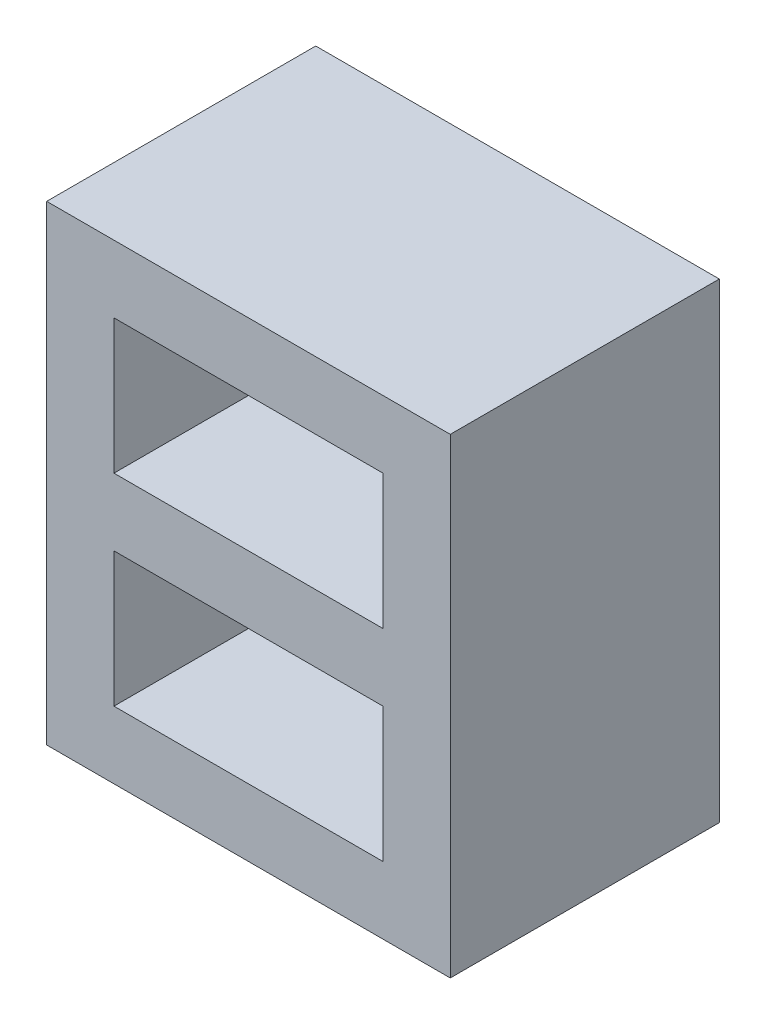
ISO-10303-21;
HEADER;
FILE_DESCRIPTION(('STEP AP214'),'2;1');
FILE_NAME('part.step','',(''),(''),'','','');
FILE_SCHEMA(('AUTOMOTIVE_DESIGN { 1 0 10303 214 1 1 1 1 }'));
ENDSEC;
DATA;
#1=APPLICATION_CONTEXT('core data for automotive mechanical design processes');
#2=APPLICATION_PROTOCOL_DEFINITION('international standard','automotive_design',2000,#1);
#3=PRODUCT_CONTEXT('',#1,'mechanical');
#4=PRODUCT('Part','Part','',(#3));
#5=PRODUCT_RELATED_PRODUCT_CATEGORY('part','',(#4));
#6=PRODUCT_DEFINITION_FORMATION('','',#4);
#7=PRODUCT_DEFINITION_CONTEXT('part definition',#1,'design');
#8=PRODUCT_DEFINITION('design','',#6,#7);
#9=PRODUCT_DEFINITION_SHAPE('','',#8);
#10=(LENGTH_UNIT() NAMED_UNIT(*) SI_UNIT(.MILLI.,.METRE.));
#11=(NAMED_UNIT(*) PLANE_ANGLE_UNIT() SI_UNIT($,.RADIAN.));
#12=(NAMED_UNIT(*) SI_UNIT($,.STERADIAN.) SOLID_ANGLE_UNIT());
#13=UNCERTAINTY_MEASURE_WITH_UNIT(LENGTH_MEASURE(1.E-05),#10,'distance_accuracy_value','');
#14=(GEOMETRIC_REPRESENTATION_CONTEXT(3) GLOBAL_UNCERTAINTY_ASSIGNED_CONTEXT((#13)) GLOBAL_UNIT_ASSIGNED_CONTEXT((#10,
#11,#12)) REPRESENTATION_CONTEXT('',''));
#15=CARTESIAN_POINT('',(0.,0.,0.));
#16=DIRECTION('',(0.,0.,1.));
#17=DIRECTION('',(1.,0.,0.));
#18=AXIS2_PLACEMENT_3D('',#15,#16,#17);
#19=CARTESIAN_POINT('',(-20.,40.,30.));
#20=DIRECTION('',(1.,0.,0.));
#21=DIRECTION('',(0.,1.,0.));
#22=AXIS2_PLACEMENT_3D('',#19,#20,#21);
#23=PLANE('',#22);
#24=DIRECTION('',(0.,0.,1.));
#25=VECTOR('',#24,1.);
#26=CARTESIAN_POINT('',(-20.,20.,30.));
#27=LINE('',#26,#25);
#28=CARTESIAN_POINT('',(-20.,20.,0.));
#29=VERTEX_POINT('',#28);
#30=CARTESIAN_POINT('',(-20.,20.,30.));
#31=VERTEX_POINT('',#30);
#32=EDGE_CURVE('E12',#29,#31,#27,.T.);
#33=ORIENTED_EDGE('',*,*,#32,.F.);
#34=DIRECTION('',(0.,-1.,0.));
#35=VECTOR('',#34,1.);
#36=CARTESIAN_POINT('',(-20.,40.,0.));
#37=LINE('',#36,#35);
#38=CARTESIAN_POINT('',(-20.,40.,0.));
#39=VERTEX_POINT('',#38);
#40=EDGE_CURVE('E758',#39,#29,#37,.T.);
#41=ORIENTED_EDGE('',*,*,#40,.F.);
#42=DIRECTION('',(0.,0.,-1.));
#43=VECTOR('',#42,1.);
#44=CARTESIAN_POINT('',(-20.,40.,30.));
#45=LINE('',#44,#43);
#46=CARTESIAN_POINT('',(-20.,40.,30.));
#47=VERTEX_POINT('',#46);
#48=EDGE_CURVE('E799',#47,#39,#45,.T.);
#49=ORIENTED_EDGE('',*,*,#48,.F.);
#50=DIRECTION('',(0.,-1.,0.));
#51=VECTOR('',#50,1.);
#52=CARTESIAN_POINT('',(-20.,40.,30.));
#53=LINE('',#52,#51);
#54=EDGE_CURVE('E761',#47,#31,#53,.T.);
#55=ORIENTED_EDGE('',*,*,#54,.T.);
#56=EDGE_LOOP('',(#33,#41,#49,#55));
#57=FACE_BOUND('',#56,.T.);
#58=ADVANCED_FACE('F684',(#57),#23,.T.);
#59=CARTESIAN_POINT('',(-20.,40.,30.));
#60=DIRECTION('',(0.,-1.,0.));
#61=DIRECTION('',(0.,0.,-1.));
#62=AXIS2_PLACEMENT_3D('',#59,#60,#61);
#63=PLANE('',#62);
#64=DIRECTION('',(-1.,0.,0.));
#65=VECTOR('',#64,1.);
#66=CARTESIAN_POINT('',(-20.,40.,0.));
#67=LINE('',#66,#65);
#68=CARTESIAN_POINT('',(20.,40.,0.));
#69=VERTEX_POINT('',#68);
#70=EDGE_CURVE('E775',#69,#39,#67,.T.);
#71=ORIENTED_EDGE('',*,*,#70,.F.);
#72=DIRECTION('',(0.,0.,-1.));
#73=VECTOR('',#72,1.);
#74=CARTESIAN_POINT('',(20.,40.,30.));
#75=LINE('',#74,#73);
#76=CARTESIAN_POINT('',(20.,40.,30.));
#77=VERTEX_POINT('',#76);
#78=EDGE_CURVE('E797',#77,#69,#75,.T.);
#79=ORIENTED_EDGE('',*,*,#78,.F.);
#80=DIRECTION('',(-1.,0.,0.));
#81=VECTOR('',#80,1.);
#82=CARTESIAN_POINT('',(-20.,40.,30.));
#83=LINE('',#82,#81);
#84=EDGE_CURVE('E860',#77,#47,#83,.T.);
#85=ORIENTED_EDGE('',*,*,#84,.T.);
#86=ORIENTED_EDGE('',*,*,#48,.T.);
#87=EDGE_LOOP('',(#71,#79,#85,#86));
#88=FACE_BOUND('',#87,.T.);
#89=ADVANCED_FACE('F913',(#88),#63,.T.);
#90=CARTESIAN_POINT('',(20.,40.,30.));
#91=DIRECTION('',(-1.,0.,0.));
#92=DIRECTION('',(0.,0.,1.));
#93=AXIS2_PLACEMENT_3D('',#90,#91,#92);
#94=PLANE('',#93);
#95=DIRECTION('',(0.,0.,-1.));
#96=VECTOR('',#95,1.);
#97=CARTESIAN_POINT('',(20.,20.,30.));
#98=LINE('',#97,#96);
#99=CARTESIAN_POINT('',(20.,20.,30.));
#100=VERTEX_POINT('',#99);
#101=CARTESIAN_POINT('',(20.,20.,0.));
#102=VERTEX_POINT('',#101);
#103=EDGE_CURVE('E693',#100,#102,#98,.T.);
#104=ORIENTED_EDGE('',*,*,#103,.F.);
#105=DIRECTION('',(0.,1.,0.));
#106=VECTOR('',#105,1.);
#107=CARTESIAN_POINT('',(20.,40.,30.));
#108=LINE('',#107,#106);
#109=EDGE_CURVE('E863',#100,#77,#108,.T.);
#110=ORIENTED_EDGE('',*,*,#109,.T.);
#111=ORIENTED_EDGE('',*,*,#78,.T.);
#112=DIRECTION('',(0.,1.,0.));
#113=VECTOR('',#112,1.);
#114=CARTESIAN_POINT('',(20.,40.,0.));
#115=LINE('',#114,#113);
#116=EDGE_CURVE('E778',#102,#69,#115,.T.);
#117=ORIENTED_EDGE('',*,*,#116,.F.);
#118=EDGE_LOOP('',(#104,#110,#111,#117));
#119=FACE_BOUND('',#118,.T.);
#120=ADVANCED_FACE('F918',(#119),#94,.T.);
#121=CARTESIAN_POINT('',(30.,40.,30.));
#122=DIRECTION('',(-1.,0.,0.));
#123=DIRECTION('',(0.,0.,1.));
#124=AXIS2_PLACEMENT_3D('',#121,#122,#123);
#125=PLANE('',#124);
#126=DIRECTION('',(0.,0.,-1.));
#127=VECTOR('',#126,1.);
#128=CARTESIAN_POINT('',(30.,50.,30.));
#129=LINE('',#128,#127);
#130=CARTESIAN_POINT('',(30.,50.,30.));
#131=VERTEX_POINT('',#130);
#132=CARTESIAN_POINT('',(30.,50.,-10.));
#133=VERTEX_POINT('',#132);
#134=EDGE_CURVE('E791',#131,#133,#129,.T.);
#135=ORIENTED_EDGE('',*,*,#134,.F.);
#136=DIRECTION('',(0.,1.,0.));
#137=VECTOR('',#136,1.);
#138=CARTESIAN_POINT('',(30.,40.,30.));
#139=LINE('',#138,#137);
#140=CARTESIAN_POINT('',(30.,-20.,30.));
#141=VERTEX_POINT('',#140);
#142=EDGE_CURVE('E864',#141,#131,#139,.T.);
#143=ORIENTED_EDGE('',*,*,#142,.F.);
#144=DIRECTION('',(0.,0.,-1.));
#145=VECTOR('',#144,1.);
#146=CARTESIAN_POINT('',(30.,-20.,30.));
#147=LINE('',#146,#145);
#148=CARTESIAN_POINT('',(30.,-20.,-10.));
#149=VERTEX_POINT('',#148);
#150=EDGE_CURVE('E776',#141,#149,#147,.T.);
#151=ORIENTED_EDGE('',*,*,#150,.T.);
#152=DIRECTION('',(0.,-1.,0.));
#153=VECTOR('',#152,1.);
#154=CARTESIAN_POINT('',(30.,0.,-10.));
#155=LINE('',#154,#153);
#156=EDGE_CURVE('E849',#133,#149,#155,.T.);
#157=ORIENTED_EDGE('',*,*,#156,.F.);
#158=EDGE_LOOP('',(#135,#143,#151,#157));
#159=FACE_BOUND('',#158,.T.);
#160=ADVANCED_FACE('F876',(#159),#125,.F.);
#161=CARTESIAN_POINT('',(-20.,50.,30.));
#162=DIRECTION('',(0.,-1.,0.));
#163=DIRECTION('',(0.,0.,-1.));
#164=AXIS2_PLACEMENT_3D('',#161,#162,#163);
#165=PLANE('',#164);
#166=ORIENTED_EDGE('',*,*,#134,.T.);
#167=DIRECTION('',(1.,0.,0.));
#168=VECTOR('',#167,1.);
#169=CARTESIAN_POINT('',(0.,50.,-10.));
#170=LINE('',#169,#168);
#171=CARTESIAN_POINT('',(-30.,50.,-10.));
#172=VERTEX_POINT('',#171);
#173=EDGE_CURVE('E817',#172,#133,#170,.T.);
#174=ORIENTED_EDGE('',*,*,#173,.F.);
#175=DIRECTION('',(0.,0.,-1.));
#176=VECTOR('',#175,1.);
#177=CARTESIAN_POINT('',(-30.,50.,30.));
#178=LINE('',#177,#176);
#179=CARTESIAN_POINT('',(-30.,50.,30.));
#180=VERTEX_POINT('',#179);
#181=EDGE_CURVE('E788',#180,#172,#178,.T.);
#182=ORIENTED_EDGE('',*,*,#181,.F.);
#183=DIRECTION('',(1.,0.,0.));
#184=VECTOR('',#183,1.);
#185=CARTESIAN_POINT('',(-20.,50.,30.));
#186=LINE('',#185,#184);
#187=EDGE_CURVE('E784',#131,#180,#186,.F.);
#188=ORIENTED_EDGE('',*,*,#187,.F.);
#189=EDGE_LOOP('',(#166,#174,#182,#188));
#190=FACE_BOUND('',#189,.T.);
#191=ADVANCED_FACE('F872',(#190),#165,.F.);
#192=CARTESIAN_POINT('',(-30.,40.,30.));
#193=DIRECTION('',(1.,0.,0.));
#194=DIRECTION('',(0.,1.,0.));
#195=AXIS2_PLACEMENT_3D('',#192,#193,#194);
#196=PLANE('',#195);
#197=ORIENTED_EDGE('',*,*,#181,.T.);
#198=DIRECTION('',(0.,-1.,0.));
#199=VECTOR('',#198,1.);
#200=CARTESIAN_POINT('',(-30.,0.,-10.));
#201=LINE('',#200,#199);
#202=CARTESIAN_POINT('',(-30.,-20.,-10.));
#203=VERTEX_POINT('',#202);
#204=EDGE_CURVE('E842',#172,#203,#201,.T.);
#205=ORIENTED_EDGE('',*,*,#204,.T.);
#206=DIRECTION('',(0.,0.,-1.));
#207=VECTOR('',#206,1.);
#208=CARTESIAN_POINT('',(-30.,-20.,30.));
#209=LINE('',#208,#207);
#210=CARTESIAN_POINT('',(-30.,-20.,30.));
#211=VERTEX_POINT('',#210);
#212=EDGE_CURVE('E781',#211,#203,#209,.T.);
#213=ORIENTED_EDGE('',*,*,#212,.F.);
#214=DIRECTION('',(0.,-1.,0.));
#215=VECTOR('',#214,1.);
#216=CARTESIAN_POINT('',(-30.,40.,30.));
#217=LINE('',#216,#215);
#218=EDGE_CURVE('E724',#180,#211,#217,.T.);
#219=ORIENTED_EDGE('',*,*,#218,.F.);
#220=EDGE_LOOP('',(#197,#205,#213,#219));
#221=FACE_BOUND('',#220,.T.);
#222=ADVANCED_FACE('F843',(#221),#196,.F.);
#223=CARTESIAN_POINT('',(0.,0.,30.));
#224=DIRECTION('',(0.,0.,-1.));
#225=DIRECTION('',(-1.,0.,0.));
#226=AXIS2_PLACEMENT_3D('',#223,#224,#225);
#227=PLANE('',#226);
#228=ORIENTED_EDGE('',*,*,#218,.T.);
#229=DIRECTION('',(1.,0.,0.));
#230=VECTOR('',#229,1.);
#231=CARTESIAN_POINT('',(0.,-20.,30.));
#232=LINE('',#231,#230);
#233=EDGE_CURVE('E769',#211,#141,#232,.T.);
#234=ORIENTED_EDGE('',*,*,#233,.T.);
#235=ORIENTED_EDGE('',*,*,#142,.T.);
#236=ORIENTED_EDGE('',*,*,#187,.T.);
#237=EDGE_LOOP('',(#228,#234,#235,#236));
#238=FACE_BOUND('',#237,.T.);
#239=DIRECTION('',(0.,1.,0.));
#240=VECTOR('',#239,1.);
#241=CARTESIAN_POINT('',(-20.,0.,30.));
#242=LINE('',#241,#240);
#243=CARTESIAN_POINT('',(-20.,-10.,30.));
#244=VERTEX_POINT('',#243);
#245=CARTESIAN_POINT('',(-20.,10.,30.));
#246=VERTEX_POINT('',#245);
#247=EDGE_CURVE('E811',#244,#246,#242,.T.);
#248=ORIENTED_EDGE('',*,*,#247,.T.);
#249=DIRECTION('',(1.,0.,0.));
#250=VECTOR('',#249,1.);
#251=CARTESIAN_POINT('',(0.,10.,30.));
#252=LINE('',#251,#250);
#253=CARTESIAN_POINT('',(20.,10.,30.));
#254=VERTEX_POINT('',#253);
#255=EDGE_CURVE('E808',#246,#254,#252,.T.);
#256=ORIENTED_EDGE('',*,*,#255,.T.);
#257=DIRECTION('',(0.,1.,0.));
#258=VECTOR('',#257,1.);
#259=CARTESIAN_POINT('',(20.,0.,30.));
#260=LINE('',#259,#258);
#261=CARTESIAN_POINT('',(20.,-10.,30.));
#262=VERTEX_POINT('',#261);
#263=EDGE_CURVE('E804',#262,#254,#260,.T.);
#264=ORIENTED_EDGE('',*,*,#263,.F.);
#265=DIRECTION('',(1.,0.,0.));
#266=VECTOR('',#265,1.);
#267=CARTESIAN_POINT('',(0.,-10.,30.));
#268=LINE('',#267,#266);
#269=EDGE_CURVE('E802',#244,#262,#268,.T.);
#270=ORIENTED_EDGE('',*,*,#269,.F.);
#271=EDGE_LOOP('',(#248,#256,#264,#270));
#272=FACE_BOUND('',#271,.T.);
#273=DIRECTION('',(1.,0.,0.));
#274=VECTOR('',#273,1.);
#275=CARTESIAN_POINT('',(0.,20.,30.));
#276=LINE('',#275,#274);
#277=EDGE_CURVE('E826',#31,#100,#276,.T.);
#278=ORIENTED_EDGE('',*,*,#277,.F.);
#279=ORIENTED_EDGE('',*,*,#54,.F.);
#280=ORIENTED_EDGE('',*,*,#84,.F.);
#281=ORIENTED_EDGE('',*,*,#109,.F.);
#282=EDGE_LOOP('',(#278,#279,#280,#281));
#283=FACE_BOUND('',#282,.T.);
#284=ADVANCED_FACE('F869',(#238,#272,#283),#227,.F.);
#285=CARTESIAN_POINT('',(-20.,0.,30.));
#286=DIRECTION('',(-1.,0.,0.));
#287=DIRECTION('',(0.,-1.,0.));
#288=AXIS2_PLACEMENT_3D('',#285,#286,#287);
#289=PLANE('',#288);
#290=DIRECTION('',(0.,1.,0.));
#291=VECTOR('',#290,1.);
#292=CARTESIAN_POINT('',(-20.,0.,0.));
#293=LINE('',#292,#291);
#294=CARTESIAN_POINT('',(-20.,-10.,0.));
#295=VERTEX_POINT('',#294);
#296=CARTESIAN_POINT('',(-20.,10.,0.));
#297=VERTEX_POINT('',#296);
#298=EDGE_CURVE('E805',#295,#297,#293,.T.);
#299=ORIENTED_EDGE('',*,*,#298,.T.);
#300=DIRECTION('',(0.,0.,-1.));
#301=VECTOR('',#300,1.);
#302=CARTESIAN_POINT('',(-20.,10.,30.));
#303=LINE('',#302,#301);
#304=EDGE_CURVE('E740',#246,#297,#303,.T.);
#305=ORIENTED_EDGE('',*,*,#304,.F.);
#306=ORIENTED_EDGE('',*,*,#247,.F.);
#307=DIRECTION('',(0.,0.,-1.));
#308=VECTOR('',#307,1.);
#309=CARTESIAN_POINT('',(-20.,-10.,30.));
#310=LINE('',#309,#308);
#311=EDGE_CURVE('E814',#244,#295,#310,.T.);
#312=ORIENTED_EDGE('',*,*,#311,.T.);
#313=EDGE_LOOP('',(#299,#305,#306,#312));
#314=FACE_BOUND('',#313,.T.);
#315=ADVANCED_FACE('F902',(#314),#289,.F.);
#316=CARTESIAN_POINT('',(0.,-20.,30.));
#317=DIRECTION('',(0.,1.,0.));
#318=DIRECTION('',(0.,0.,1.));
#319=AXIS2_PLACEMENT_3D('',#316,#317,#318);
#320=PLANE('',#319);
#321=ORIENTED_EDGE('',*,*,#212,.T.);
#322=DIRECTION('',(1.,0.,0.));
#323=VECTOR('',#322,1.);
#324=CARTESIAN_POINT('',(0.,-20.,-10.));
#325=LINE('',#324,#323);
#326=EDGE_CURVE('E837',#203,#149,#325,.T.);
#327=ORIENTED_EDGE('',*,*,#326,.T.);
#328=ORIENTED_EDGE('',*,*,#150,.F.);
#329=ORIENTED_EDGE('',*,*,#233,.F.);
#330=EDGE_LOOP('',(#321,#327,#328,#329));
#331=FACE_BOUND('',#330,.T.);
#332=ADVANCED_FACE('F686',(#331),#320,.F.);
#333=CARTESIAN_POINT('',(0.,-10.,30.));
#334=DIRECTION('',(0.,1.,0.));
#335=DIRECTION('',(0.,0.,1.));
#336=AXIS2_PLACEMENT_3D('',#333,#334,#335);
#337=PLANE('',#336);
#338=DIRECTION('',(1.,0.,0.));
#339=VECTOR('',#338,1.);
#340=CARTESIAN_POINT('',(0.,-10.,0.));
#341=LINE('',#340,#339);
#342=CARTESIAN_POINT('',(20.,-10.,0.));
#343=VERTEX_POINT('',#342);
#344=EDGE_CURVE('E731',#295,#343,#341,.T.);
#345=ORIENTED_EDGE('',*,*,#344,.F.);
#346=ORIENTED_EDGE('',*,*,#311,.F.);
#347=ORIENTED_EDGE('',*,*,#269,.T.);
#348=DIRECTION('',(0.,0.,-1.));
#349=VECTOR('',#348,1.);
#350=CARTESIAN_POINT('',(20.,-10.,30.));
#351=LINE('',#350,#349);
#352=EDGE_CURVE('E770',#262,#343,#351,.T.);
#353=ORIENTED_EDGE('',*,*,#352,.T.);
#354=EDGE_LOOP('',(#345,#346,#347,#353));
#355=FACE_BOUND('',#354,.T.);
#356=ADVANCED_FACE('F897',(#355),#337,.T.);
#357=CARTESIAN_POINT('',(20.,0.,30.));
#358=DIRECTION('',(-1.,0.,0.));
#359=DIRECTION('',(0.,0.,1.));
#360=AXIS2_PLACEMENT_3D('',#357,#358,#359);
#361=PLANE('',#360);
#362=DIRECTION('',(0.,1.,0.));
#363=VECTOR('',#362,1.);
#364=CARTESIAN_POINT('',(20.,0.,0.));
#365=LINE('',#364,#363);
#366=CARTESIAN_POINT('',(20.,10.,0.));
#367=VERTEX_POINT('',#366);
#368=EDGE_CURVE('E816',#343,#367,#365,.T.);
#369=ORIENTED_EDGE('',*,*,#368,.F.);
#370=ORIENTED_EDGE('',*,*,#352,.F.);
#371=ORIENTED_EDGE('',*,*,#263,.T.);
#372=DIRECTION('',(0.,0.,-1.));
#373=VECTOR('',#372,1.);
#374=CARTESIAN_POINT('',(20.,10.,30.));
#375=LINE('',#374,#373);
#376=EDGE_CURVE('E794',#254,#367,#375,.T.);
#377=ORIENTED_EDGE('',*,*,#376,.T.);
#378=EDGE_LOOP('',(#369,#370,#371,#377));
#379=FACE_BOUND('',#378,.T.);
#380=ADVANCED_FACE('F896',(#379),#361,.T.);
#381=CARTESIAN_POINT('',(0.,10.,30.));
#382=DIRECTION('',(0.,1.,0.));
#383=DIRECTION('',(0.,0.,1.));
#384=AXIS2_PLACEMENT_3D('',#381,#382,#383);
#385=PLANE('',#384);
#386=DIRECTION('',(1.,0.,0.));
#387=VECTOR('',#386,1.);
#388=CARTESIAN_POINT('',(0.,10.,0.));
#389=LINE('',#388,#387);
#390=EDGE_CURVE('E820',#297,#367,#389,.T.);
#391=ORIENTED_EDGE('',*,*,#390,.T.);
#392=ORIENTED_EDGE('',*,*,#376,.F.);
#393=ORIENTED_EDGE('',*,*,#255,.F.);
#394=ORIENTED_EDGE('',*,*,#304,.T.);
#395=EDGE_LOOP('',(#391,#392,#393,#394));
#396=FACE_BOUND('',#395,.T.);
#397=ADVANCED_FACE('F888',(#396),#385,.F.);
#398=CARTESIAN_POINT('',(0.,20.,30.));
#399=DIRECTION('',(0.,1.,0.));
#400=DIRECTION('',(0.,0.,1.));
#401=AXIS2_PLACEMENT_3D('',#398,#399,#400);
#402=PLANE('',#401);
#403=DIRECTION('',(1.,0.,0.));
#404=VECTOR('',#403,1.);
#405=CARTESIAN_POINT('',(0.,20.,0.));
#406=LINE('',#405,#404);
#407=EDGE_CURVE('E765',#29,#102,#406,.T.);
#408=ORIENTED_EDGE('',*,*,#407,.F.);
#409=ORIENTED_EDGE('',*,*,#32,.T.);
#410=ORIENTED_EDGE('',*,*,#277,.T.);
#411=ORIENTED_EDGE('',*,*,#103,.T.);
#412=EDGE_LOOP('',(#408,#409,#410,#411));
#413=FACE_BOUND('',#412,.T.);
#414=ADVANCED_FACE('F766',(#413),#402,.T.);
#415=CARTESIAN_POINT('',(0.,0.,0.));
#416=DIRECTION('',(0.,0.,1.));
#417=DIRECTION('',(1.,0.,0.));
#418=AXIS2_PLACEMENT_3D('',#415,#416,#417);
#419=PLANE('',#418);
#420=ORIENTED_EDGE('',*,*,#70,.T.);
#421=ORIENTED_EDGE('',*,*,#40,.T.);
#422=ORIENTED_EDGE('',*,*,#407,.T.);
#423=ORIENTED_EDGE('',*,*,#116,.T.);
#424=EDGE_LOOP('',(#420,#421,#422,#423));
#425=FACE_BOUND('',#424,.T.);
#426=ADVANCED_FACE('F773',(#425),#419,.T.);
#427=ORIENTED_EDGE('',*,*,#390,.F.);
#428=ORIENTED_EDGE('',*,*,#298,.F.);
#429=ORIENTED_EDGE('',*,*,#344,.T.);
#430=ORIENTED_EDGE('',*,*,#368,.T.);
#431=EDGE_LOOP('',(#427,#428,#429,#430));
#432=FACE_BOUND('',#431,.T.);
#433=ADVANCED_FACE('F900',(#432),#419,.T.);
#434=CARTESIAN_POINT('',(0.,0.,-10.));
#435=DIRECTION('',(0.,0.,1.));
#436=DIRECTION('',(1.,0.,0.));
#437=AXIS2_PLACEMENT_3D('',#434,#435,#436);
#438=PLANE('',#437);
#439=ORIENTED_EDGE('',*,*,#156,.T.);
#440=ORIENTED_EDGE('',*,*,#326,.F.);
#441=ORIENTED_EDGE('',*,*,#204,.F.);
#442=ORIENTED_EDGE('',*,*,#173,.T.);
#443=EDGE_LOOP('',(#439,#440,#441,#442));
#444=FACE_BOUND('',#443,.T.);
#445=ADVANCED_FACE('F852',(#444),#438,.F.);
#446=CLOSED_SHELL('',(#58,#89,#120,#160,#191,#222,#284,#315,#332,#356,#380,#397,#414,#426,#433,#445));
#447=MANIFOLD_SOLID_BREP('B2',#446);
#448=ADVANCED_BREP_SHAPE_REPRESENTATION('',(#18,#447),#14);
#449=SHAPE_DEFINITION_REPRESENTATION(#9,#448);
ENDSEC;
END-ISO-10303-21;
